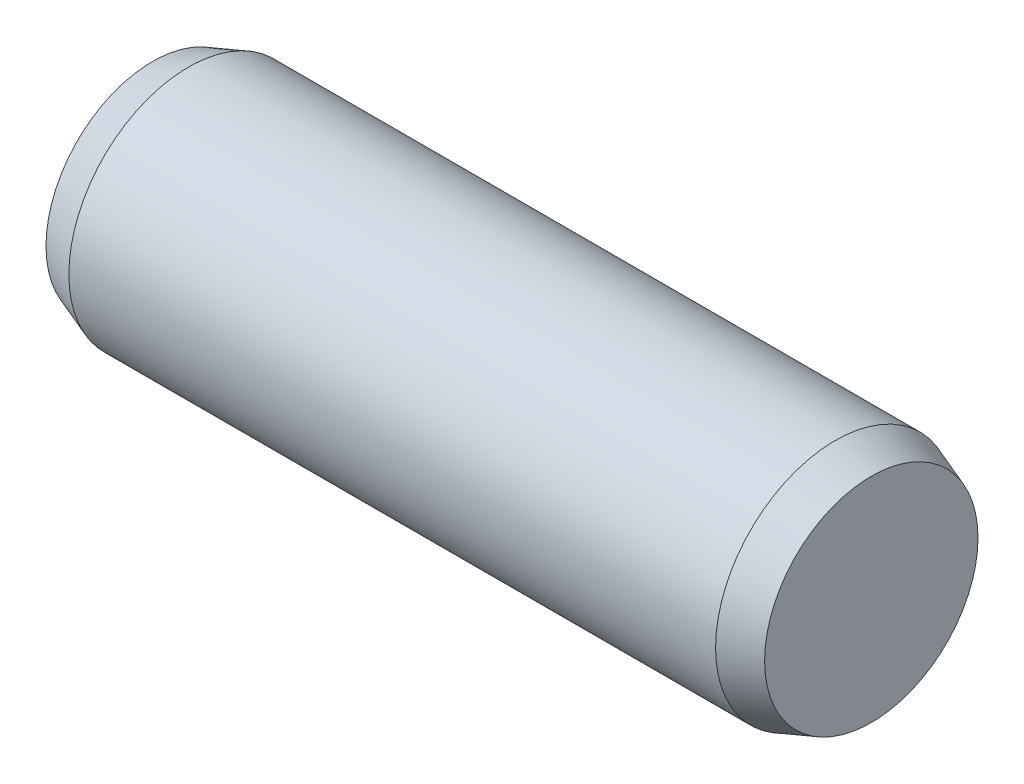
ISO-10303-21;
HEADER;
FILE_DESCRIPTION(('STEP AP214'),'2;1');
FILE_NAME('part.step','',(''),(''),'','','');
FILE_SCHEMA(('AUTOMOTIVE_DESIGN { 1 0 10303 214 1 1 1 1 }'));
ENDSEC;
DATA;
#1=APPLICATION_CONTEXT('core data for automotive mechanical design processes');
#2=APPLICATION_PROTOCOL_DEFINITION('international standard','automotive_design',2000,#1);
#3=PRODUCT_CONTEXT('',#1,'mechanical');
#4=PRODUCT('Part','Part','',(#3));
#5=PRODUCT_RELATED_PRODUCT_CATEGORY('part','',(#4));
#6=PRODUCT_DEFINITION_FORMATION('','',#4);
#7=PRODUCT_DEFINITION_CONTEXT('part definition',#1,'design');
#8=PRODUCT_DEFINITION('design','',#6,#7);
#9=PRODUCT_DEFINITION_SHAPE('','',#8);
#10=(LENGTH_UNIT() NAMED_UNIT(*) SI_UNIT(.MILLI.,.METRE.));
#11=(NAMED_UNIT(*) PLANE_ANGLE_UNIT() SI_UNIT($,.RADIAN.));
#12=(NAMED_UNIT(*) SI_UNIT($,.STERADIAN.) SOLID_ANGLE_UNIT());
#13=UNCERTAINTY_MEASURE_WITH_UNIT(LENGTH_MEASURE(1.E-05),#10,'distance_accuracy_value','');
#14=(GEOMETRIC_REPRESENTATION_CONTEXT(3) GLOBAL_UNCERTAINTY_ASSIGNED_CONTEXT((#13)) GLOBAL_UNIT_ASSIGNED_CONTEXT((#10,
#11,#12)) REPRESENTATION_CONTEXT('',''));
#15=CARTESIAN_POINT('',(0.,0.,0.));
#16=DIRECTION('',(0.,0.,1.));
#17=DIRECTION('',(1.,0.,0.));
#18=AXIS2_PLACEMENT_3D('',#15,#16,#17);
#19=CARTESIAN_POINT('',(3.,0.,0.));
#20=DIRECTION('',(1.,0.,0.));
#21=DIRECTION('',(0.,0.,-1.));
#22=AXIS2_PLACEMENT_3D('',#19,#20,#21);
#23=PLANE('',#22);
#24=CARTESIAN_POINT('',(3.00000000004275,0.,0.));
#25=DIRECTION('',(-1.,0.,0.));
#26=DIRECTION('',(0.,0.,1.));
#27=AXIS2_PLACEMENT_3D('',#24,#25,#26);
#28=CIRCLE('',#27,0.890908929717849);
#29=CARTESIAN_POINT('',(3.00000000004275,0.,0.890908929717849));
#30=VERTEX_POINT('',#29);
#31=EDGE_CURVE('E18',#30,#30,#28,.T.);
#32=ORIENTED_EDGE('',*,*,#31,.F.);
#33=EDGE_LOOP('',(#32));
#34=FACE_BOUND('',#33,.T.);
#35=ADVANCED_FACE('F15',(#34),#23,.T.);
#36=CARTESIAN_POINT('',(-3.,0.,0.));
#37=DIRECTION('',(1.,0.,0.));
#38=DIRECTION('',(0.,0.,-1.));
#39=AXIS2_PLACEMENT_3D('',#36,#37,#38);
#40=PLANE('',#39);
#41=CARTESIAN_POINT('',(-3.00000000004275,0.,0.));
#42=DIRECTION('',(1.,0.,0.));
#43=DIRECTION('',(0.,0.,-1.));
#44=AXIS2_PLACEMENT_3D('',#41,#42,#43);
#45=CIRCLE('',#44,0.890908929717849);
#46=CARTESIAN_POINT('',(-3.00000000004275,0.,-0.890908929717849));
#47=VERTEX_POINT('',#46);
#48=EDGE_CURVE('E27',#47,#47,#45,.T.);
#49=ORIENTED_EDGE('',*,*,#48,.F.);
#50=EDGE_LOOP('',(#49));
#51=FACE_BOUND('',#50,.T.);
#52=ADVANCED_FACE('F38',(#51),#40,.F.);
#53=CARTESIAN_POINT('',(2.70000000023174,0.,0.));
#54=DIRECTION('',(-1.,0.,0.));
#55=DIRECTION('',(0.,0.,1.));
#56=AXIS2_PLACEMENT_3D('',#53,#54,#55);
#57=CONICAL_SURFACE('',#56,1.00009999994199,0.349065850437344);
#58=CARTESIAN_POINT('',(2.7,0.,0.));
#59=DIRECTION('',(-1.,0.,0.));
#60=DIRECTION('',(0.,0.,1.));
#61=AXIS2_PLACEMENT_3D('',#58,#59,#60);
#62=CIRCLE('',#61,1.0001);
#63=CARTESIAN_POINT('',(2.7,0.,1.0001));
#64=VERTEX_POINT('',#63);
#65=EDGE_CURVE('E22',#64,#64,#62,.T.);
#66=ORIENTED_EDGE('',*,*,#65,.F.);
#67=EDGE_LOOP('',(#66));
#68=FACE_BOUND('',#67,.T.);
#69=ORIENTED_EDGE('',*,*,#31,.T.);
#70=EDGE_LOOP('',(#69));
#71=FACE_BOUND('',#70,.T.);
#72=ADVANCED_FACE('F35',(#68,#71),#57,.T.);
#73=CARTESIAN_POINT('',(-2.70000000023174,0.,0.));
#74=DIRECTION('',(1.,0.,0.));
#75=DIRECTION('',(0.,0.,-1.));
#76=AXIS2_PLACEMENT_3D('',#73,#74,#75);
#77=CONICAL_SURFACE('',#76,1.00009999994199,0.349065850437344);
#78=CARTESIAN_POINT('',(-2.7,0.,0.));
#79=DIRECTION('',(-1.,0.,0.));
#80=DIRECTION('',(0.,0.,1.));
#81=AXIS2_PLACEMENT_3D('',#78,#79,#80);
#82=CIRCLE('',#81,1.0001);
#83=CARTESIAN_POINT('',(-2.7,0.,1.0001));
#84=VERTEX_POINT('',#83);
#85=EDGE_CURVE('E10',#84,#84,#82,.F.);
#86=ORIENTED_EDGE('',*,*,#85,.F.);
#87=EDGE_LOOP('',(#86));
#88=FACE_BOUND('',#87,.T.);
#89=ORIENTED_EDGE('',*,*,#48,.T.);
#90=EDGE_LOOP('',(#89));
#91=FACE_BOUND('',#90,.T.);
#92=ADVANCED_FACE('F46',(#88,#91),#77,.T.);
#93=CARTESIAN_POINT('',(3.,0.,0.));
#94=DIRECTION('',(-1.,0.,0.));
#95=DIRECTION('',(0.,0.,1.));
#96=AXIS2_PLACEMENT_3D('',#93,#94,#95);
#97=CYLINDRICAL_SURFACE('',#96,1.0001);
#98=ORIENTED_EDGE('',*,*,#85,.T.);
#99=EDGE_LOOP('',(#98));
#100=FACE_BOUND('',#99,.T.);
#101=ORIENTED_EDGE('',*,*,#65,.T.);
#102=EDGE_LOOP('',(#101));
#103=FACE_BOUND('',#102,.T.);
#104=ADVANCED_FACE('F44',(#100,#103),#97,.T.);
#105=CLOSED_SHELL('',(#35,#52,#72,#92,#104));
#106=MANIFOLD_SOLID_BREP('B1',#105);
#107=ADVANCED_BREP_SHAPE_REPRESENTATION('',(#18,#106),#14);
#108=SHAPE_DEFINITION_REPRESENTATION(#9,#107);
ENDSEC;
END-ISO-10303-21;
